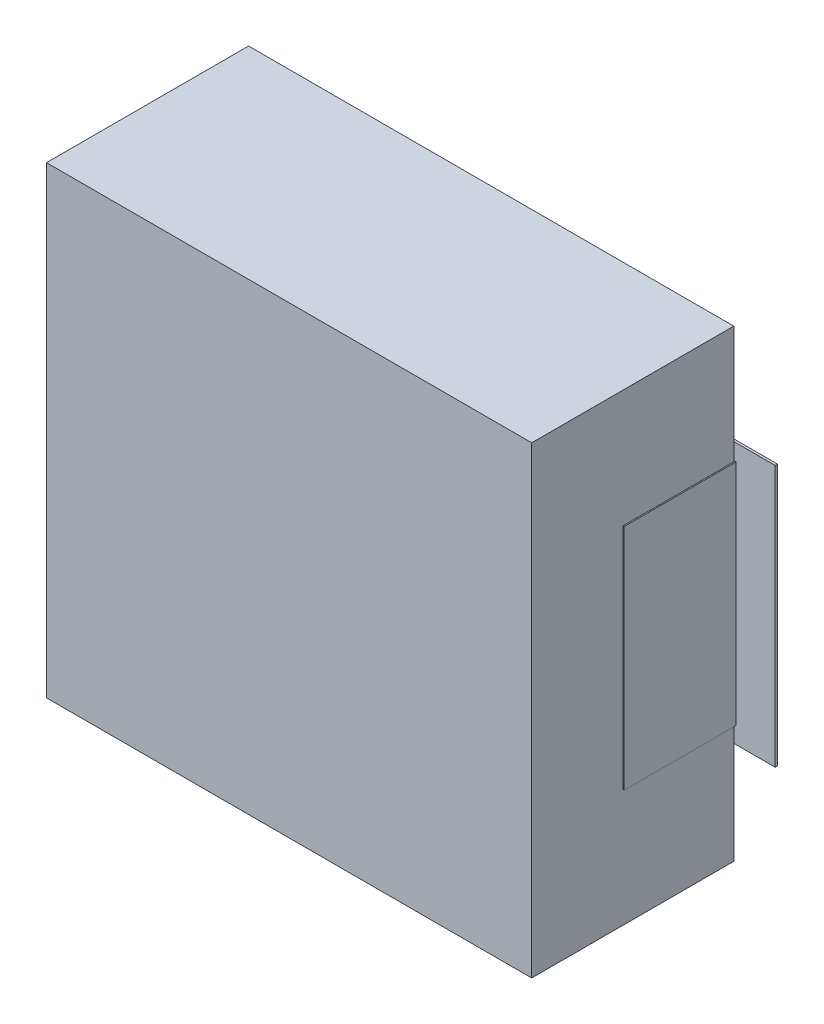
ISO-10303-21;
HEADER;
FILE_DESCRIPTION(('STEP AP214'),'2;1');
FILE_NAME('part.step','',(''),(''),'','','');
FILE_SCHEMA(('AUTOMOTIVE_DESIGN { 1 0 10303 214 1 1 1 1 }'));
ENDSEC;
DATA;
#1=APPLICATION_CONTEXT('core data for automotive mechanical design processes');
#2=APPLICATION_PROTOCOL_DEFINITION('international standard','automotive_design',2000,#1);
#3=PRODUCT_CONTEXT('',#1,'mechanical');
#4=PRODUCT('Part','Part','',(#3));
#5=PRODUCT_RELATED_PRODUCT_CATEGORY('part','',(#4));
#6=PRODUCT_DEFINITION_FORMATION('','',#4);
#7=PRODUCT_DEFINITION_CONTEXT('part definition',#1,'design');
#8=PRODUCT_DEFINITION('design','',#6,#7);
#9=PRODUCT_DEFINITION_SHAPE('','',#8);
#10=(LENGTH_UNIT() NAMED_UNIT(*) SI_UNIT(.MILLI.,.METRE.));
#11=(NAMED_UNIT(*) PLANE_ANGLE_UNIT() SI_UNIT($,.RADIAN.));
#12=(NAMED_UNIT(*) SI_UNIT($,.STERADIAN.) SOLID_ANGLE_UNIT());
#13=UNCERTAINTY_MEASURE_WITH_UNIT(LENGTH_MEASURE(1.E-05),#10,'distance_accuracy_value','');
#14=(GEOMETRIC_REPRESENTATION_CONTEXT(3) GLOBAL_UNCERTAINTY_ASSIGNED_CONTEXT((#13)) GLOBAL_UNIT_ASSIGNED_CONTEXT((#10,
#11,#12)) REPRESENTATION_CONTEXT('',''));
#15=CARTESIAN_POINT('',(0.,0.,0.));
#16=DIRECTION('',(0.,0.,1.));
#17=DIRECTION('',(1.,0.,0.));
#18=AXIS2_PLACEMENT_3D('',#15,#16,#17);
#19=CARTESIAN_POINT('',(1.375,-1.,0.0762));
#20=DIRECTION('',(0.,-1.,0.));
#21=DIRECTION('',(0.,0.,-1.));
#22=AXIS2_PLACEMENT_3D('',#19,#20,#21);
#23=PLANE('',#22);
#24=DIRECTION('',(0.,0.,-1.));
#25=VECTOR('',#24,1.);
#26=CARTESIAN_POINT('',(2.135,-1.,1.0762));
#27=LINE('',#26,#25);
#28=CARTESIAN_POINT('',(2.135,-1.,1.0762));
#29=VERTEX_POINT('',#28);
#30=CARTESIAN_POINT('',(2.135,-1.,0.0962));
#31=VERTEX_POINT('',#30);
#32=EDGE_CURVE('E313',#29,#31,#27,.T.);
#33=ORIENTED_EDGE('',*,*,#32,.F.);
#34=DIRECTION('',(-1.,0.,0.));
#35=VECTOR('',#34,1.);
#36=CARTESIAN_POINT('',(2.135,-1.,1.0762));
#37=LINE('',#36,#35);
#38=CARTESIAN_POINT('',(2.125,-1.,1.0762));
#39=VERTEX_POINT('',#38);
#40=EDGE_CURVE('E348',#29,#39,#37,.T.);
#41=ORIENTED_EDGE('',*,*,#40,.T.);
#42=DIRECTION('',(0.,0.,-1.));
#43=VECTOR('',#42,1.);
#44=CARTESIAN_POINT('',(2.125,-1.,1.0762));
#45=LINE('',#44,#43);
#46=CARTESIAN_POINT('',(2.125,-1.,0.1062));
#47=VERTEX_POINT('',#46);
#48=EDGE_CURVE('E400',#39,#47,#45,.T.);
#49=ORIENTED_EDGE('',*,*,#48,.T.);
#50=DIRECTION('',(-1.,0.,0.));
#51=VECTOR('',#50,1.);
#52=CARTESIAN_POINT('',(2.125,-1.,0.1062));
#53=LINE('',#52,#51);
#54=CARTESIAN_POINT('',(1.375,-1.,0.1062));
#55=VERTEX_POINT('',#54);
#56=EDGE_CURVE('E349',#47,#55,#53,.T.);
#57=ORIENTED_EDGE('',*,*,#56,.T.);
#58=DIRECTION('',(0.,0.,1.));
#59=VECTOR('',#58,1.);
#60=CARTESIAN_POINT('',(1.375,-1.,0.0962));
#61=LINE('',#60,#59);
#62=CARTESIAN_POINT('',(1.375,-1.,0.0962));
#63=VERTEX_POINT('',#62);
#64=EDGE_CURVE('E270',#63,#55,#61,.T.);
#65=ORIENTED_EDGE('',*,*,#64,.F.);
#66=DIRECTION('',(1.,0.,0.));
#67=VECTOR('',#66,1.);
#68=CARTESIAN_POINT('',(1.375,-1.,0.0962));
#69=LINE('',#68,#67);
#70=EDGE_CURVE('E145',#63,#31,#69,.T.);
#71=ORIENTED_EDGE('',*,*,#70,.T.);
#72=EDGE_LOOP('',(#33,#41,#49,#57,#65,#71));
#73=FACE_BOUND('',#72,.T.);
#74=ADVANCED_FACE('F16',(#73),#23,.T.);
#75=CARTESIAN_POINT('',(-2.225,-2.03,0.0762));
#76=DIRECTION('',(0.,-1.,0.));
#77=DIRECTION('',(0.,0.,-1.));
#78=AXIS2_PLACEMENT_3D('',#75,#76,#77);
#79=PLANE('',#78);
#80=DIRECTION('',(1.,0.,0.));
#81=VECTOR('',#80,1.);
#82=CARTESIAN_POINT('',(-2.125,-2.03,0.1062));
#83=LINE('',#82,#81);
#84=CARTESIAN_POINT('',(-2.125,-2.03,0.1062));
#85=VERTEX_POINT('',#84);
#86=CARTESIAN_POINT('',(2.125,-2.03,0.1062));
#87=VERTEX_POINT('',#86);
#88=EDGE_CURVE('E352',#85,#87,#83,.T.);
#89=ORIENTED_EDGE('',*,*,#88,.T.);
#90=DIRECTION('',(0.,0.,1.));
#91=VECTOR('',#90,1.);
#92=CARTESIAN_POINT('',(2.125,-2.03,0.1062));
#93=LINE('',#92,#91);
#94=CARTESIAN_POINT('',(2.125,-2.03,1.8762));
#95=VERTEX_POINT('',#94);
#96=EDGE_CURVE('E186',#87,#95,#93,.T.);
#97=ORIENTED_EDGE('',*,*,#96,.T.);
#98=DIRECTION('',(1.,0.,0.));
#99=VECTOR('',#98,1.);
#100=CARTESIAN_POINT('',(-2.125,-2.03,1.8762));
#101=LINE('',#100,#99);
#102=CARTESIAN_POINT('',(-2.125,-2.03,1.8762));
#103=VERTEX_POINT('',#102);
#104=EDGE_CURVE('E217',#103,#95,#101,.T.);
#105=ORIENTED_EDGE('',*,*,#104,.F.);
#106=DIRECTION('',(0.,0.,1.));
#107=VECTOR('',#106,1.);
#108=CARTESIAN_POINT('',(-2.125,-2.03,0.1062));
#109=LINE('',#108,#107);
#110=EDGE_CURVE('E236',#85,#103,#109,.T.);
#111=ORIENTED_EDGE('',*,*,#110,.F.);
#112=EDGE_LOOP('',(#89,#97,#105,#111));
#113=FACE_BOUND('',#112,.T.);
#114=ADVANCED_FACE('F672',(#113),#79,.T.);
#115=CARTESIAN_POINT('',(-1.375,-1.,0.0762));
#116=DIRECTION('',(1.,0.,0.));
#117=DIRECTION('',(0.,1.,0.));
#118=AXIS2_PLACEMENT_3D('',#115,#116,#117);
#119=PLANE('',#118);
#120=DIRECTION('',(0.,1.,0.));
#121=VECTOR('',#120,1.);
#122=CARTESIAN_POINT('',(-1.375,-1.,0.0962));
#123=LINE('',#122,#121);
#124=CARTESIAN_POINT('',(-1.375,-1.,0.0962));
#125=VERTEX_POINT('',#124);
#126=CARTESIAN_POINT('',(-1.375,1.,0.0962));
#127=VERTEX_POINT('',#126);
#128=EDGE_CURVE('E326',#125,#127,#123,.T.);
#129=ORIENTED_EDGE('',*,*,#128,.T.);
#130=DIRECTION('',(0.,0.,1.));
#131=VECTOR('',#130,1.);
#132=CARTESIAN_POINT('',(-1.375,1.,0.0962));
#133=LINE('',#132,#131);
#134=CARTESIAN_POINT('',(-1.375,1.,0.1062));
#135=VERTEX_POINT('',#134);
#136=EDGE_CURVE('E176',#127,#135,#133,.T.);
#137=ORIENTED_EDGE('',*,*,#136,.T.);
#138=DIRECTION('',(0.,1.,0.));
#139=VECTOR('',#138,1.);
#140=CARTESIAN_POINT('',(-1.375,-1.,0.1062));
#141=LINE('',#140,#139);
#142=CARTESIAN_POINT('',(-1.375,-1.,0.1062));
#143=VERTEX_POINT('',#142);
#144=EDGE_CURVE('E227',#143,#135,#141,.T.);
#145=ORIENTED_EDGE('',*,*,#144,.F.);
#146=DIRECTION('',(0.,0.,1.));
#147=VECTOR('',#146,1.);
#148=CARTESIAN_POINT('',(-1.375,-1.,0.0962));
#149=LINE('',#148,#147);
#150=EDGE_CURVE('E11',#125,#143,#149,.T.);
#151=ORIENTED_EDGE('',*,*,#150,.F.);
#152=EDGE_LOOP('',(#129,#137,#145,#151));
#153=FACE_BOUND('',#152,.T.);
#154=ADVANCED_FACE('F552',(#153),#119,.T.);
#155=CARTESIAN_POINT('',(-2.135,-1.,0.0762));
#156=DIRECTION('',(0.,-1.,0.));
#157=DIRECTION('',(0.,0.,-1.));
#158=AXIS2_PLACEMENT_3D('',#155,#156,#157);
#159=PLANE('',#158);
#160=DIRECTION('',(0.,0.,-1.));
#161=VECTOR('',#160,1.);
#162=CARTESIAN_POINT('',(-2.135,-1.,1.0762));
#163=LINE('',#162,#161);
#164=CARTESIAN_POINT('',(-2.135,-1.,1.0762));
#165=VERTEX_POINT('',#164);
#166=CARTESIAN_POINT('',(-2.135,-1.,0.0962));
#167=VERTEX_POINT('',#166);
#168=EDGE_CURVE('E27',#165,#167,#163,.T.);
#169=ORIENTED_EDGE('',*,*,#168,.T.);
#170=DIRECTION('',(1.,0.,0.));
#171=VECTOR('',#170,1.);
#172=CARTESIAN_POINT('',(-2.135,-1.,0.0962));
#173=LINE('',#172,#171);
#174=EDGE_CURVE('E301',#167,#125,#173,.T.);
#175=ORIENTED_EDGE('',*,*,#174,.T.);
#176=ORIENTED_EDGE('',*,*,#150,.T.);
#177=DIRECTION('',(1.,0.,0.));
#178=VECTOR('',#177,1.);
#179=CARTESIAN_POINT('',(-2.125,-1.,0.1062));
#180=LINE('',#179,#178);
#181=CARTESIAN_POINT('',(-2.125,-1.,0.1062));
#182=VERTEX_POINT('',#181);
#183=EDGE_CURVE('E231',#182,#143,#180,.T.);
#184=ORIENTED_EDGE('',*,*,#183,.F.);
#185=DIRECTION('',(0.,0.,-1.));
#186=VECTOR('',#185,1.);
#187=CARTESIAN_POINT('',(-2.125,-1.,1.0762));
#188=LINE('',#187,#186);
#189=CARTESIAN_POINT('',(-2.125,-1.,1.0762));
#190=VERTEX_POINT('',#189);
#191=EDGE_CURVE('E240',#190,#182,#188,.T.);
#192=ORIENTED_EDGE('',*,*,#191,.F.);
#193=DIRECTION('',(-1.,0.,0.));
#194=VECTOR('',#193,1.);
#195=CARTESIAN_POINT('',(-2.125,-1.,1.0762));
#196=LINE('',#195,#194);
#197=EDGE_CURVE('E278',#190,#165,#196,.T.);
#198=ORIENTED_EDGE('',*,*,#197,.T.);
#199=EDGE_LOOP('',(#169,#175,#176,#184,#192,#198));
#200=FACE_BOUND('',#199,.T.);
#201=ADVANCED_FACE('F555',(#200),#159,.T.);
#202=CARTESIAN_POINT('',(-2.135,1.,0.0762));
#203=DIRECTION('',(-1.,0.,0.));
#204=DIRECTION('',(0.,0.,1.));
#205=AXIS2_PLACEMENT_3D('',#202,#203,#204);
#206=PLANE('',#205);
#207=DIRECTION('',(0.,0.,-1.));
#208=VECTOR('',#207,1.);
#209=CARTESIAN_POINT('',(-2.135,1.,1.0762));
#210=LINE('',#209,#208);
#211=CARTESIAN_POINT('',(-2.135,1.,1.0762));
#212=VERTEX_POINT('',#211);
#213=CARTESIAN_POINT('',(-2.135,1.,0.0962));
#214=VERTEX_POINT('',#213);
#215=EDGE_CURVE('E249',#212,#214,#210,.T.);
#216=ORIENTED_EDGE('',*,*,#215,.T.);
#217=DIRECTION('',(0.,-1.,0.));
#218=VECTOR('',#217,1.);
#219=CARTESIAN_POINT('',(-2.135,1.,0.0962));
#220=LINE('',#219,#218);
#221=EDGE_CURVE('E353',#214,#167,#220,.T.);
#222=ORIENTED_EDGE('',*,*,#221,.T.);
#223=ORIENTED_EDGE('',*,*,#168,.F.);
#224=DIRECTION('',(0.,1.,0.));
#225=VECTOR('',#224,1.);
#226=CARTESIAN_POINT('',(-2.135,-1.,1.0762));
#227=LINE('',#226,#225);
#228=EDGE_CURVE('E262',#165,#212,#227,.T.);
#229=ORIENTED_EDGE('',*,*,#228,.T.);
#230=EDGE_LOOP('',(#216,#222,#223,#229));
#231=FACE_BOUND('',#230,.T.);
#232=ADVANCED_FACE('F540',(#231),#206,.T.);
#233=CARTESIAN_POINT('',(-1.375,1.,0.0762));
#234=DIRECTION('',(0.,1.,0.));
#235=DIRECTION('',(1.,0.,0.));
#236=AXIS2_PLACEMENT_3D('',#233,#234,#235);
#237=PLANE('',#236);
#238=ORIENTED_EDGE('',*,*,#215,.F.);
#239=DIRECTION('',(1.,0.,0.));
#240=VECTOR('',#239,1.);
#241=CARTESIAN_POINT('',(-2.135,1.,1.0762));
#242=LINE('',#241,#240);
#243=CARTESIAN_POINT('',(-2.125,1.,1.0762));
#244=VERTEX_POINT('',#243);
#245=EDGE_CURVE('E258',#212,#244,#242,.T.);
#246=ORIENTED_EDGE('',*,*,#245,.T.);
#247=DIRECTION('',(0.,0.,-1.));
#248=VECTOR('',#247,1.);
#249=CARTESIAN_POINT('',(-2.125,1.,1.0762));
#250=LINE('',#249,#248);
#251=CARTESIAN_POINT('',(-2.125,1.,0.1062));
#252=VERTEX_POINT('',#251);
#253=EDGE_CURVE('E239',#244,#252,#250,.T.);
#254=ORIENTED_EDGE('',*,*,#253,.T.);
#255=DIRECTION('',(1.,0.,0.));
#256=VECTOR('',#255,1.);
#257=CARTESIAN_POINT('',(-2.125,1.,0.1062));
#258=LINE('',#257,#256);
#259=EDGE_CURVE('E230',#252,#135,#258,.T.);
#260=ORIENTED_EDGE('',*,*,#259,.T.);
#261=ORIENTED_EDGE('',*,*,#136,.F.);
#262=DIRECTION('',(-1.,0.,0.));
#263=VECTOR('',#262,1.);
#264=CARTESIAN_POINT('',(-1.375,1.,0.0962));
#265=LINE('',#264,#263);
#266=EDGE_CURVE('E329',#127,#214,#265,.T.);
#267=ORIENTED_EDGE('',*,*,#266,.T.);
#268=EDGE_LOOP('',(#238,#246,#254,#260,#261,#267));
#269=FACE_BOUND('',#268,.T.);
#270=ADVANCED_FACE('F18',(#269),#237,.T.);
#271=CARTESIAN_POINT('',(-2.125,-2.03,1.8762));
#272=DIRECTION('',(1.,0.,0.));
#273=DIRECTION('',(0.,1.,0.));
#274=AXIS2_PLACEMENT_3D('',#271,#272,#273);
#275=PLANE('',#274);
#276=DIRECTION('',(0.,-1.,0.));
#277=VECTOR('',#276,1.);
#278=CARTESIAN_POINT('',(-2.125,1.,1.0762));
#279=LINE('',#278,#277);
#280=EDGE_CURVE('E263',#244,#190,#279,.T.);
#281=ORIENTED_EDGE('',*,*,#280,.T.);
#282=ORIENTED_EDGE('',*,*,#191,.T.);
#283=DIRECTION('',(0.,-1.,0.));
#284=VECTOR('',#283,1.);
#285=CARTESIAN_POINT('',(-2.125,-1.,0.1062));
#286=LINE('',#285,#284);
#287=EDGE_CURVE('E20',#182,#85,#286,.T.);
#288=ORIENTED_EDGE('',*,*,#287,.T.);
#289=ORIENTED_EDGE('',*,*,#110,.T.);
#290=DIRECTION('',(0.,1.,0.));
#291=VECTOR('',#290,1.);
#292=CARTESIAN_POINT('',(-2.125,-2.03,1.8762));
#293=LINE('',#292,#291);
#294=CARTESIAN_POINT('',(-2.125,2.03,1.8762));
#295=VERTEX_POINT('',#294);
#296=EDGE_CURVE('E214',#103,#295,#293,.T.);
#297=ORIENTED_EDGE('',*,*,#296,.T.);
#298=DIRECTION('',(0.,0.,1.));
#299=VECTOR('',#298,1.);
#300=CARTESIAN_POINT('',(-2.125,2.03,0.1062));
#301=LINE('',#300,#299);
#302=CARTESIAN_POINT('',(-2.125,2.03,0.1062));
#303=VERTEX_POINT('',#302);
#304=EDGE_CURVE('E41',#303,#295,#301,.T.);
#305=ORIENTED_EDGE('',*,*,#304,.F.);
#306=DIRECTION('',(0.,-1.,0.));
#307=VECTOR('',#306,1.);
#308=CARTESIAN_POINT('',(-2.125,2.03,0.1062));
#309=LINE('',#308,#307);
#310=EDGE_CURVE('E232',#303,#252,#309,.T.);
#311=ORIENTED_EDGE('',*,*,#310,.T.);
#312=ORIENTED_EDGE('',*,*,#253,.F.);
#313=EDGE_LOOP('',(#281,#282,#288,#289,#297,#305,#311,#312));
#314=FACE_BOUND('',#313,.T.);
#315=ADVANCED_FACE('F545',(#314),#275,.F.);
#316=CARTESIAN_POINT('',(2.225,2.03,0.0762));
#317=DIRECTION('',(0.,1.,0.));
#318=DIRECTION('',(1.,0.,0.));
#319=AXIS2_PLACEMENT_3D('',#316,#317,#318);
#320=PLANE('',#319);
#321=DIRECTION('',(-1.,0.,0.));
#322=VECTOR('',#321,1.);
#323=CARTESIAN_POINT('',(2.125,2.03,0.1062));
#324=LINE('',#323,#322);
#325=CARTESIAN_POINT('',(2.125,2.03,0.1062));
#326=VERTEX_POINT('',#325);
#327=EDGE_CURVE('E235',#326,#303,#324,.T.);
#328=ORIENTED_EDGE('',*,*,#327,.T.);
#329=ORIENTED_EDGE('',*,*,#304,.T.);
#330=DIRECTION('',(-1.,0.,0.));
#331=VECTOR('',#330,1.);
#332=CARTESIAN_POINT('',(2.125,2.03,1.8762));
#333=LINE('',#332,#331);
#334=CARTESIAN_POINT('',(2.125,2.03,1.8762));
#335=VERTEX_POINT('',#334);
#336=EDGE_CURVE('E209',#335,#295,#333,.T.);
#337=ORIENTED_EDGE('',*,*,#336,.F.);
#338=DIRECTION('',(0.,0.,1.));
#339=VECTOR('',#338,1.);
#340=CARTESIAN_POINT('',(2.125,2.03,0.1062));
#341=LINE('',#340,#339);
#342=EDGE_CURVE('E195',#326,#335,#341,.T.);
#343=ORIENTED_EDGE('',*,*,#342,.F.);
#344=EDGE_LOOP('',(#328,#329,#337,#343));
#345=FACE_BOUND('',#344,.T.);
#346=ADVANCED_FACE('F210',(#345),#320,.T.);
#347=CARTESIAN_POINT('',(0.,0.,0.1062));
#348=DIRECTION('',(0.,0.,-1.));
#349=DIRECTION('',(0.,-1.,0.));
#350=AXIS2_PLACEMENT_3D('',#347,#348,#349);
#351=PLANE('',#350);
#352=DIRECTION('',(0.,-1.,0.));
#353=VECTOR('',#352,1.);
#354=CARTESIAN_POINT('',(2.125,2.03,0.1062));
#355=LINE('',#354,#353);
#356=CARTESIAN_POINT('',(2.125,1.,0.1062));
#357=VERTEX_POINT('',#356);
#358=EDGE_CURVE('E204',#326,#357,#355,.T.);
#359=ORIENTED_EDGE('',*,*,#358,.T.);
#360=DIRECTION('',(-1.,0.,0.));
#361=VECTOR('',#360,1.);
#362=CARTESIAN_POINT('',(2.125,1.,0.1062));
#363=LINE('',#362,#361);
#364=CARTESIAN_POINT('',(1.375,1.,0.1062));
#365=VERTEX_POINT('',#364);
#366=EDGE_CURVE('E318',#357,#365,#363,.T.);
#367=ORIENTED_EDGE('',*,*,#366,.T.);
#368=DIRECTION('',(0.,-1.,0.));
#369=VECTOR('',#368,1.);
#370=CARTESIAN_POINT('',(1.375,1.,0.1062));
#371=LINE('',#370,#369);
#372=EDGE_CURVE('E133',#365,#55,#371,.T.);
#373=ORIENTED_EDGE('',*,*,#372,.T.);
#374=ORIENTED_EDGE('',*,*,#56,.F.);
#375=DIRECTION('',(0.,-1.,0.));
#376=VECTOR('',#375,1.);
#377=CARTESIAN_POINT('',(2.125,-1.,0.1062));
#378=LINE('',#377,#376);
#379=EDGE_CURVE('E396',#47,#87,#378,.T.);
#380=ORIENTED_EDGE('',*,*,#379,.T.);
#381=ORIENTED_EDGE('',*,*,#88,.F.);
#382=ORIENTED_EDGE('',*,*,#287,.F.);
#383=ORIENTED_EDGE('',*,*,#183,.T.);
#384=ORIENTED_EDGE('',*,*,#144,.T.);
#385=ORIENTED_EDGE('',*,*,#259,.F.);
#386=ORIENTED_EDGE('',*,*,#310,.F.);
#387=ORIENTED_EDGE('',*,*,#327,.F.);
#388=EDGE_LOOP('',(#359,#367,#373,#374,#380,#381,#382,#383,#384,#385,#386,#387));
#389=FACE_BOUND('',#388,.T.);
#390=ADVANCED_FACE('F550',(#389),#351,.T.);
#391=CARTESIAN_POINT('',(1.375,1.,0.0762));
#392=DIRECTION('',(-1.,0.,0.));
#393=DIRECTION('',(0.,0.,1.));
#394=AXIS2_PLACEMENT_3D('',#391,#392,#393);
#395=PLANE('',#394);
#396=DIRECTION('',(0.,-1.,0.));
#397=VECTOR('',#396,1.);
#398=CARTESIAN_POINT('',(1.375,1.,0.0962));
#399=LINE('',#398,#397);
#400=CARTESIAN_POINT('',(1.375,1.,0.0962));
#401=VERTEX_POINT('',#400);
#402=EDGE_CURVE('E285',#401,#63,#399,.T.);
#403=ORIENTED_EDGE('',*,*,#402,.T.);
#404=ORIENTED_EDGE('',*,*,#64,.T.);
#405=ORIENTED_EDGE('',*,*,#372,.F.);
#406=DIRECTION('',(0.,0.,1.));
#407=VECTOR('',#406,1.);
#408=CARTESIAN_POINT('',(1.375,1.,0.0962));
#409=LINE('',#408,#407);
#410=EDGE_CURVE('E385',#401,#365,#409,.T.);
#411=ORIENTED_EDGE('',*,*,#410,.F.);
#412=EDGE_LOOP('',(#403,#404,#405,#411));
#413=FACE_BOUND('',#412,.T.);
#414=ADVANCED_FACE('F607',(#413),#395,.T.);
#415=CARTESIAN_POINT('',(2.478,-1.145,0.0762));
#416=DIRECTION('',(1.,0.,0.));
#417=DIRECTION('',(0.,1.,0.));
#418=AXIS2_PLACEMENT_3D('',#415,#416,#417);
#419=PLANE('',#418);
#420=DIRECTION('',(0.,1.,0.));
#421=VECTOR('',#420,1.);
#422=CARTESIAN_POINT('',(2.478,-1.145,0.0762));
#423=LINE('',#422,#421);
#424=CARTESIAN_POINT('',(2.478,-1.145,0.0762));
#425=VERTEX_POINT('',#424);
#426=CARTESIAN_POINT('',(2.478,1.145,0.0762));
#427=VERTEX_POINT('',#426);
#428=EDGE_CURVE('E344',#425,#427,#423,.T.);
#429=ORIENTED_EDGE('',*,*,#428,.T.);
#430=DIRECTION('',(0.,0.,1.));
#431=VECTOR('',#430,1.);
#432=CARTESIAN_POINT('',(2.478,1.145,0.0762));
#433=LINE('',#432,#431);
#434=CARTESIAN_POINT('',(2.478,1.145,0.0962));
#435=VERTEX_POINT('',#434);
#436=EDGE_CURVE('E376',#427,#435,#433,.T.);
#437=ORIENTED_EDGE('',*,*,#436,.T.);
#438=DIRECTION('',(0.,1.,0.));
#439=VECTOR('',#438,1.);
#440=CARTESIAN_POINT('',(2.478,-1.145,0.0962));
#441=LINE('',#440,#439);
#442=CARTESIAN_POINT('',(2.478,-1.145,0.0962));
#443=VERTEX_POINT('',#442);
#444=EDGE_CURVE('E276',#443,#435,#441,.T.);
#445=ORIENTED_EDGE('',*,*,#444,.F.);
#446=DIRECTION('',(0.,0.,1.));
#447=VECTOR('',#446,1.);
#448=CARTESIAN_POINT('',(2.478,-1.145,0.0762));
#449=LINE('',#448,#447);
#450=EDGE_CURVE('E267',#425,#443,#449,.T.);
#451=ORIENTED_EDGE('',*,*,#450,.F.);
#452=EDGE_LOOP('',(#429,#437,#445,#451));
#453=FACE_BOUND('',#452,.T.);
#454=ADVANCED_FACE('F602',(#453),#419,.T.);
#455=CARTESIAN_POINT('',(1.078,-1.145,0.0762));
#456=DIRECTION('',(0.,-1.,0.));
#457=DIRECTION('',(0.,0.,-1.));
#458=AXIS2_PLACEMENT_3D('',#455,#456,#457);
#459=PLANE('',#458);
#460=DIRECTION('',(1.,0.,0.));
#461=VECTOR('',#460,1.);
#462=CARTESIAN_POINT('',(1.078,-1.145,0.0762));
#463=LINE('',#462,#461);
#464=CARTESIAN_POINT('',(1.078,-1.145,0.0762));
#465=VERTEX_POINT('',#464);
#466=EDGE_CURVE('E359',#465,#425,#463,.T.);
#467=ORIENTED_EDGE('',*,*,#466,.T.);
#468=ORIENTED_EDGE('',*,*,#450,.T.);
#469=DIRECTION('',(1.,0.,0.));
#470=VECTOR('',#469,1.);
#471=CARTESIAN_POINT('',(1.078,-1.145,0.0962));
#472=LINE('',#471,#470);
#473=CARTESIAN_POINT('',(1.078,-1.145,0.0962));
#474=VERTEX_POINT('',#473);
#475=EDGE_CURVE('E272',#474,#443,#472,.T.);
#476=ORIENTED_EDGE('',*,*,#475,.F.);
#477=DIRECTION('',(0.,0.,1.));
#478=VECTOR('',#477,1.);
#479=CARTESIAN_POINT('',(1.078,-1.145,0.0762));
#480=LINE('',#479,#478);
#481=EDGE_CURVE('E271',#465,#474,#480,.T.);
#482=ORIENTED_EDGE('',*,*,#481,.F.);
#483=EDGE_LOOP('',(#467,#468,#476,#482));
#484=FACE_BOUND('',#483,.T.);
#485=ADVANCED_FACE('F454',(#484),#459,.T.);
#486=CARTESIAN_POINT('',(1.078,1.145,0.0762));
#487=DIRECTION('',(-1.,0.,0.));
#488=DIRECTION('',(0.,0.,1.));
#489=AXIS2_PLACEMENT_3D('',#486,#487,#488);
#490=PLANE('',#489);
#491=DIRECTION('',(0.,-1.,0.));
#492=VECTOR('',#491,1.);
#493=CARTESIAN_POINT('',(1.078,1.145,0.0762));
#494=LINE('',#493,#492);
#495=CARTESIAN_POINT('',(1.078,1.145,0.0762));
#496=VERTEX_POINT('',#495);
#497=EDGE_CURVE('E322',#496,#465,#494,.T.);
#498=ORIENTED_EDGE('',*,*,#497,.T.);
#499=ORIENTED_EDGE('',*,*,#481,.T.);
#500=DIRECTION('',(0.,-1.,0.));
#501=VECTOR('',#500,1.);
#502=CARTESIAN_POINT('',(1.078,1.145,0.0962));
#503=LINE('',#502,#501);
#504=CARTESIAN_POINT('',(1.078,1.145,0.0962));
#505=VERTEX_POINT('',#504);
#506=EDGE_CURVE('E277',#505,#474,#503,.T.);
#507=ORIENTED_EDGE('',*,*,#506,.F.);
#508=DIRECTION('',(0.,0.,1.));
#509=VECTOR('',#508,1.);
#510=CARTESIAN_POINT('',(1.078,1.145,0.0762));
#511=LINE('',#510,#509);
#512=EDGE_CURVE('E300',#496,#505,#511,.T.);
#513=ORIENTED_EDGE('',*,*,#512,.F.);
#514=EDGE_LOOP('',(#498,#499,#507,#513));
#515=FACE_BOUND('',#514,.T.);
#516=ADVANCED_FACE('F443',(#515),#490,.T.);
#517=CARTESIAN_POINT('',(-2.478,1.145,0.0762));
#518=DIRECTION('',(-1.,0.,0.));
#519=DIRECTION('',(0.,0.,1.));
#520=AXIS2_PLACEMENT_3D('',#517,#518,#519);
#521=PLANE('',#520);
#522=DIRECTION('',(0.,-1.,0.));
#523=VECTOR('',#522,1.);
#524=CARTESIAN_POINT('',(-2.478,1.145,0.0762));
#525=LINE('',#524,#523);
#526=CARTESIAN_POINT('',(-2.478,1.145,0.0762));
#527=VERTEX_POINT('',#526);
#528=CARTESIAN_POINT('',(-2.478,-1.145,0.0762));
#529=VERTEX_POINT('',#528);
#530=EDGE_CURVE('E334',#527,#529,#525,.T.);
#531=ORIENTED_EDGE('',*,*,#530,.T.);
#532=DIRECTION('',(0.,0.,1.));
#533=VECTOR('',#532,1.);
#534=CARTESIAN_POINT('',(-2.478,-1.145,0.0762));
#535=LINE('',#534,#533);
#536=CARTESIAN_POINT('',(-2.478,-1.145,0.0962));
#537=VERTEX_POINT('',#536);
#538=EDGE_CURVE('E306',#529,#537,#535,.T.);
#539=ORIENTED_EDGE('',*,*,#538,.T.);
#540=DIRECTION('',(0.,-1.,0.));
#541=VECTOR('',#540,1.);
#542=CARTESIAN_POINT('',(-2.478,1.145,0.0962));
#543=LINE('',#542,#541);
#544=CARTESIAN_POINT('',(-2.478,1.145,0.0962));
#545=VERTEX_POINT('',#544);
#546=EDGE_CURVE('E241',#545,#537,#543,.T.);
#547=ORIENTED_EDGE('',*,*,#546,.F.);
#548=DIRECTION('',(0.,0.,1.));
#549=VECTOR('',#548,1.);
#550=CARTESIAN_POINT('',(-2.478,1.145,0.0762));
#551=LINE('',#550,#549);
#552=EDGE_CURVE('E319',#527,#545,#551,.T.);
#553=ORIENTED_EDGE('',*,*,#552,.F.);
#554=EDGE_LOOP('',(#531,#539,#547,#553));
#555=FACE_BOUND('',#554,.T.);
#556=ADVANCED_FACE('F499',(#555),#521,.T.);
#557=CARTESIAN_POINT('',(-2.478,-1.145,0.0762));
#558=DIRECTION('',(0.,-1.,0.));
#559=DIRECTION('',(0.,0.,-1.));
#560=AXIS2_PLACEMENT_3D('',#557,#558,#559);
#561=PLANE('',#560);
#562=DIRECTION('',(1.,0.,0.));
#563=VECTOR('',#562,1.);
#564=CARTESIAN_POINT('',(-2.478,-1.145,0.0762));
#565=LINE('',#564,#563);
#566=CARTESIAN_POINT('',(-1.078,-1.145,0.0762));
#567=VERTEX_POINT('',#566);
#568=EDGE_CURVE('E330',#529,#567,#565,.T.);
#569=ORIENTED_EDGE('',*,*,#568,.T.);
#570=DIRECTION('',(0.,0.,1.));
#571=VECTOR('',#570,1.);
#572=CARTESIAN_POINT('',(-1.078,-1.145,0.0762));
#573=LINE('',#572,#571);
#574=CARTESIAN_POINT('',(-1.078,-1.145,0.0962));
#575=VERTEX_POINT('',#574);
#576=EDGE_CURVE('E302',#567,#575,#573,.T.);
#577=ORIENTED_EDGE('',*,*,#576,.T.);
#578=DIRECTION('',(1.,0.,0.));
#579=VECTOR('',#578,1.);
#580=CARTESIAN_POINT('',(-2.478,-1.145,0.0962));
#581=LINE('',#580,#579);
#582=EDGE_CURVE('E245',#537,#575,#581,.T.);
#583=ORIENTED_EDGE('',*,*,#582,.F.);
#584=ORIENTED_EDGE('',*,*,#538,.F.);
#585=EDGE_LOOP('',(#569,#577,#583,#584));
#586=FACE_BOUND('',#585,.T.);
#587=ADVANCED_FACE('F658',(#586),#561,.T.);
#588=CARTESIAN_POINT('',(-1.078,-1.145,0.0762));
#589=DIRECTION('',(1.,0.,0.));
#590=DIRECTION('',(0.,1.,0.));
#591=AXIS2_PLACEMENT_3D('',#588,#589,#590);
#592=PLANE('',#591);
#593=DIRECTION('',(0.,1.,0.));
#594=VECTOR('',#593,1.);
#595=CARTESIAN_POINT('',(-1.078,-1.145,0.0762));
#596=LINE('',#595,#594);
#597=CARTESIAN_POINT('',(-1.078,1.145,0.0762));
#598=VERTEX_POINT('',#597);
#599=EDGE_CURVE('E335',#567,#598,#596,.T.);
#600=ORIENTED_EDGE('',*,*,#599,.T.);
#601=DIRECTION('',(0.,0.,1.));
#602=VECTOR('',#601,1.);
#603=CARTESIAN_POINT('',(-1.078,1.145,0.0762));
#604=LINE('',#603,#602);
#605=CARTESIAN_POINT('',(-1.078,1.145,0.0962));
#606=VERTEX_POINT('',#605);
#607=EDGE_CURVE('E307',#598,#606,#604,.T.);
#608=ORIENTED_EDGE('',*,*,#607,.T.);
#609=DIRECTION('',(0.,1.,0.));
#610=VECTOR('',#609,1.);
#611=CARTESIAN_POINT('',(-1.078,-1.145,0.0962));
#612=LINE('',#611,#610);
#613=EDGE_CURVE('E295',#575,#606,#612,.T.);
#614=ORIENTED_EDGE('',*,*,#613,.F.);
#615=ORIENTED_EDGE('',*,*,#576,.F.);
#616=EDGE_LOOP('',(#600,#608,#614,#615));
#617=FACE_BOUND('',#616,.T.);
#618=ADVANCED_FACE('F493',(#617),#592,.T.);
#619=CARTESIAN_POINT('',(-1.078,1.145,0.0762));
#620=DIRECTION('',(0.,1.,0.));
#621=DIRECTION('',(1.,0.,0.));
#622=AXIS2_PLACEMENT_3D('',#619,#620,#621);
#623=PLANE('',#622);
#624=DIRECTION('',(-1.,0.,0.));
#625=VECTOR('',#624,1.);
#626=CARTESIAN_POINT('',(-1.078,1.145,0.0762));
#627=LINE('',#626,#625);
#628=EDGE_CURVE('E372',#598,#527,#627,.T.);
#629=ORIENTED_EDGE('',*,*,#628,.T.);
#630=ORIENTED_EDGE('',*,*,#552,.T.);
#631=DIRECTION('',(-1.,0.,0.));
#632=VECTOR('',#631,1.);
#633=CARTESIAN_POINT('',(-1.078,1.145,0.0962));
#634=LINE('',#633,#632);
#635=EDGE_CURVE('E246',#606,#545,#634,.T.);
#636=ORIENTED_EDGE('',*,*,#635,.F.);
#637=ORIENTED_EDGE('',*,*,#607,.F.);
#638=EDGE_LOOP('',(#629,#630,#636,#637));
#639=FACE_BOUND('',#638,.T.);
#640=ADVANCED_FACE('F488',(#639),#623,.T.);
#641=CARTESIAN_POINT('',(0.,0.,0.0762));
#642=DIRECTION('',(0.,0.,1.));
#643=DIRECTION('',(1.,0.,0.));
#644=AXIS2_PLACEMENT_3D('',#641,#642,#643);
#645=PLANE('',#644);
#646=DIRECTION('',(-1.,0.,0.));
#647=VECTOR('',#646,1.);
#648=CARTESIAN_POINT('',(2.478,1.145,0.0762));
#649=LINE('',#648,#647);
#650=EDGE_CURVE('E296',#427,#496,#649,.T.);
#651=ORIENTED_EDGE('',*,*,#650,.F.);
#652=ORIENTED_EDGE('',*,*,#428,.F.);
#653=ORIENTED_EDGE('',*,*,#466,.F.);
#654=ORIENTED_EDGE('',*,*,#497,.F.);
#655=EDGE_LOOP('',(#651,#652,#653,#654));
#656=FACE_BOUND('',#655,.T.);
#657=ADVANCED_FACE('F452',(#656),#645,.F.);
#658=CARTESIAN_POINT('',(0.,0.,0.0762));
#659=DIRECTION('',(0.,0.,1.));
#660=DIRECTION('',(1.,0.,0.));
#661=AXIS2_PLACEMENT_3D('',#658,#659,#660);
#662=PLANE('',#661);
#663=ORIENTED_EDGE('',*,*,#628,.F.);
#664=ORIENTED_EDGE('',*,*,#599,.F.);
#665=ORIENTED_EDGE('',*,*,#568,.F.);
#666=ORIENTED_EDGE('',*,*,#530,.F.);
#667=EDGE_LOOP('',(#663,#664,#665,#666));
#668=FACE_BOUND('',#667,.T.);
#669=ADVANCED_FACE('F497',(#668),#662,.F.);
#670=CARTESIAN_POINT('',(2.478,1.145,0.0762));
#671=DIRECTION('',(0.,1.,0.));
#672=DIRECTION('',(1.,0.,0.));
#673=AXIS2_PLACEMENT_3D('',#670,#671,#672);
#674=PLANE('',#673);
#675=ORIENTED_EDGE('',*,*,#650,.T.);
#676=ORIENTED_EDGE('',*,*,#512,.T.);
#677=DIRECTION('',(-1.,0.,0.));
#678=VECTOR('',#677,1.);
#679=CARTESIAN_POINT('',(2.478,1.145,0.0962));
#680=LINE('',#679,#678);
#681=EDGE_CURVE('E377',#435,#505,#680,.T.);
#682=ORIENTED_EDGE('',*,*,#681,.F.);
#683=ORIENTED_EDGE('',*,*,#436,.F.);
#684=EDGE_LOOP('',(#675,#676,#682,#683));
#685=FACE_BOUND('',#684,.T.);
#686=ADVANCED_FACE('F575',(#685),#674,.T.);
#687=CARTESIAN_POINT('',(0.,0.,0.0962));
#688=DIRECTION('',(0.,0.,1.));
#689=DIRECTION('',(1.,0.,0.));
#690=AXIS2_PLACEMENT_3D('',#687,#688,#689);
#691=PLANE('',#690);
#692=ORIENTED_EDGE('',*,*,#221,.F.);
#693=ORIENTED_EDGE('',*,*,#266,.F.);
#694=ORIENTED_EDGE('',*,*,#128,.F.);
#695=ORIENTED_EDGE('',*,*,#174,.F.);
#696=EDGE_LOOP('',(#692,#693,#694,#695));
#697=FACE_BOUND('',#696,.T.);
#698=ORIENTED_EDGE('',*,*,#635,.T.);
#699=ORIENTED_EDGE('',*,*,#546,.T.);
#700=ORIENTED_EDGE('',*,*,#582,.T.);
#701=ORIENTED_EDGE('',*,*,#613,.T.);
#702=EDGE_LOOP('',(#698,#699,#700,#701));
#703=FACE_BOUND('',#702,.T.);
#704=ADVANCED_FACE('F503',(#697,#703),#691,.T.);
#705=CARTESIAN_POINT('',(0.,0.,0.0962));
#706=DIRECTION('',(0.,0.,1.));
#707=DIRECTION('',(1.,0.,0.));
#708=AXIS2_PLACEMENT_3D('',#705,#706,#707);
#709=PLANE('',#708);
#710=DIRECTION('',(-1.,0.,0.));
#711=VECTOR('',#710,1.);
#712=CARTESIAN_POINT('',(2.135,1.,0.0962));
#713=LINE('',#712,#711);
#714=CARTESIAN_POINT('',(2.135,1.,0.0962));
#715=VERTEX_POINT('',#714);
#716=EDGE_CURVE('E225',#715,#401,#713,.T.);
#717=ORIENTED_EDGE('',*,*,#716,.F.);
#718=DIRECTION('',(0.,1.,0.));
#719=VECTOR('',#718,1.);
#720=CARTESIAN_POINT('',(2.135,-1.,0.0962));
#721=LINE('',#720,#719);
#722=EDGE_CURVE('E317',#31,#715,#721,.T.);
#723=ORIENTED_EDGE('',*,*,#722,.F.);
#724=ORIENTED_EDGE('',*,*,#70,.F.);
#725=ORIENTED_EDGE('',*,*,#402,.F.);
#726=EDGE_LOOP('',(#717,#723,#724,#725));
#727=FACE_BOUND('',#726,.T.);
#728=ORIENTED_EDGE('',*,*,#681,.T.);
#729=ORIENTED_EDGE('',*,*,#506,.T.);
#730=ORIENTED_EDGE('',*,*,#475,.T.);
#731=ORIENTED_EDGE('',*,*,#444,.T.);
#732=EDGE_LOOP('',(#728,#729,#730,#731));
#733=FACE_BOUND('',#732,.T.);
#734=ADVANCED_FACE('F457',(#727,#733),#709,.T.);
#735=CARTESIAN_POINT('',(2.135,-1.,0.0762));
#736=DIRECTION('',(1.,0.,0.));
#737=DIRECTION('',(0.,1.,0.));
#738=AXIS2_PLACEMENT_3D('',#735,#736,#737);
#739=PLANE('',#738);
#740=DIRECTION('',(0.,0.,-1.));
#741=VECTOR('',#740,1.);
#742=CARTESIAN_POINT('',(2.135,1.,1.0762));
#743=LINE('',#742,#741);
#744=CARTESIAN_POINT('',(2.135,1.,1.0762));
#745=VERTEX_POINT('',#744);
#746=EDGE_CURVE('E282',#745,#715,#743,.T.);
#747=ORIENTED_EDGE('',*,*,#746,.F.);
#748=DIRECTION('',(0.,-1.,0.));
#749=VECTOR('',#748,1.);
#750=CARTESIAN_POINT('',(2.135,1.,1.0762));
#751=LINE('',#750,#749);
#752=EDGE_CURVE('E340',#745,#29,#751,.T.);
#753=ORIENTED_EDGE('',*,*,#752,.T.);
#754=ORIENTED_EDGE('',*,*,#32,.T.);
#755=ORIENTED_EDGE('',*,*,#722,.T.);
#756=EDGE_LOOP('',(#747,#753,#754,#755));
#757=FACE_BOUND('',#756,.T.);
#758=ADVANCED_FACE('F581',(#757),#739,.T.);
#759=CARTESIAN_POINT('',(2.135,1.,0.0762));
#760=DIRECTION('',(0.,1.,0.));
#761=DIRECTION('',(1.,0.,0.));
#762=AXIS2_PLACEMENT_3D('',#759,#760,#761);
#763=PLANE('',#762);
#764=ORIENTED_EDGE('',*,*,#746,.T.);
#765=ORIENTED_EDGE('',*,*,#716,.T.);
#766=ORIENTED_EDGE('',*,*,#410,.T.);
#767=ORIENTED_EDGE('',*,*,#366,.F.);
#768=DIRECTION('',(0.,0.,-1.));
#769=VECTOR('',#768,1.);
#770=CARTESIAN_POINT('',(2.125,1.,1.0762));
#771=LINE('',#770,#769);
#772=CARTESIAN_POINT('',(2.125,1.,1.0762));
#773=VERTEX_POINT('',#772);
#774=EDGE_CURVE('E253',#773,#357,#771,.T.);
#775=ORIENTED_EDGE('',*,*,#774,.F.);
#776=DIRECTION('',(1.,0.,0.));
#777=VECTOR('',#776,1.);
#778=CARTESIAN_POINT('',(2.125,1.,1.0762));
#779=LINE('',#778,#777);
#780=EDGE_CURVE('E336',#773,#745,#779,.T.);
#781=ORIENTED_EDGE('',*,*,#780,.T.);
#782=EDGE_LOOP('',(#764,#765,#766,#767,#775,#781));
#783=FACE_BOUND('',#782,.T.);
#784=ADVANCED_FACE('F586',(#783),#763,.T.);
#785=CARTESIAN_POINT('',(0.,0.,1.0762));
#786=DIRECTION('',(0.,0.,1.));
#787=DIRECTION('',(1.,0.,0.));
#788=AXIS2_PLACEMENT_3D('',#785,#786,#787);
#789=PLANE('',#788);
#790=ORIENTED_EDGE('',*,*,#280,.F.);
#791=ORIENTED_EDGE('',*,*,#245,.F.);
#792=ORIENTED_EDGE('',*,*,#228,.F.);
#793=ORIENTED_EDGE('',*,*,#197,.F.);
#794=EDGE_LOOP('',(#790,#791,#792,#793));
#795=FACE_BOUND('',#794,.T.);
#796=ADVANCED_FACE('F544',(#795),#789,.T.);
#797=CARTESIAN_POINT('',(0.,0.,1.0762));
#798=DIRECTION('',(0.,0.,1.));
#799=DIRECTION('',(1.,0.,0.));
#800=AXIS2_PLACEMENT_3D('',#797,#798,#799);
#801=PLANE('',#800);
#802=DIRECTION('',(0.,-1.,0.));
#803=VECTOR('',#802,1.);
#804=CARTESIAN_POINT('',(2.125,1.,1.0762));
#805=LINE('',#804,#803);
#806=EDGE_CURVE('E252',#773,#39,#805,.T.);
#807=ORIENTED_EDGE('',*,*,#806,.T.);
#808=ORIENTED_EDGE('',*,*,#40,.F.);
#809=ORIENTED_EDGE('',*,*,#752,.F.);
#810=ORIENTED_EDGE('',*,*,#780,.F.);
#811=EDGE_LOOP('',(#807,#808,#809,#810));
#812=FACE_BOUND('',#811,.T.);
#813=ADVANCED_FACE('F637',(#812),#801,.T.);
#814=CARTESIAN_POINT('',(2.125,2.03,1.8762));
#815=DIRECTION('',(-1.,0.,0.));
#816=DIRECTION('',(0.,0.,1.));
#817=AXIS2_PLACEMENT_3D('',#814,#815,#816);
#818=PLANE('',#817);
#819=ORIENTED_EDGE('',*,*,#806,.F.);
#820=ORIENTED_EDGE('',*,*,#774,.T.);
#821=ORIENTED_EDGE('',*,*,#358,.F.);
#822=ORIENTED_EDGE('',*,*,#342,.T.);
#823=DIRECTION('',(0.,1.,0.));
#824=VECTOR('',#823,1.);
#825=CARTESIAN_POINT('',(2.125,-2.03,1.8762));
#826=LINE('',#825,#824);
#827=EDGE_CURVE('E200',#95,#335,#826,.T.);
#828=ORIENTED_EDGE('',*,*,#827,.F.);
#829=ORIENTED_EDGE('',*,*,#96,.F.);
#830=ORIENTED_EDGE('',*,*,#379,.F.);
#831=ORIENTED_EDGE('',*,*,#48,.F.);
#832=EDGE_LOOP('',(#819,#820,#821,#822,#828,#829,#830,#831));
#833=FACE_BOUND('',#832,.T.);
#834=ADVANCED_FACE('F198',(#833),#818,.F.);
#835=CARTESIAN_POINT('',(0.,0.,1.8762));
#836=DIRECTION('',(0.,0.,1.));
#837=DIRECTION('',(1.,0.,0.));
#838=AXIS2_PLACEMENT_3D('',#835,#836,#837);
#839=PLANE('',#838);
#840=ORIENTED_EDGE('',*,*,#827,.T.);
#841=ORIENTED_EDGE('',*,*,#336,.T.);
#842=ORIENTED_EDGE('',*,*,#296,.F.);
#843=ORIENTED_EDGE('',*,*,#104,.T.);
#844=EDGE_LOOP('',(#840,#841,#842,#843));
#845=FACE_BOUND('',#844,.T.);
#846=ADVANCED_FACE('F216',(#845),#839,.T.);
#847=CLOSED_SHELL('',(#74,#114,#154,#201,#232,#270,#315,#346,#390,#414,#454,#485,#516,#556,#587,
#618,#640,#657,#669,#686,#704,#734,#758,#784,#796,#813,#834,#846));
#848=MANIFOLD_SOLID_BREP('B1',#847);
#849=ADVANCED_BREP_SHAPE_REPRESENTATION('',(#18,#848),#14);
#850=SHAPE_DEFINITION_REPRESENTATION(#9,#849);
ENDSEC;
END-ISO-10303-21;
